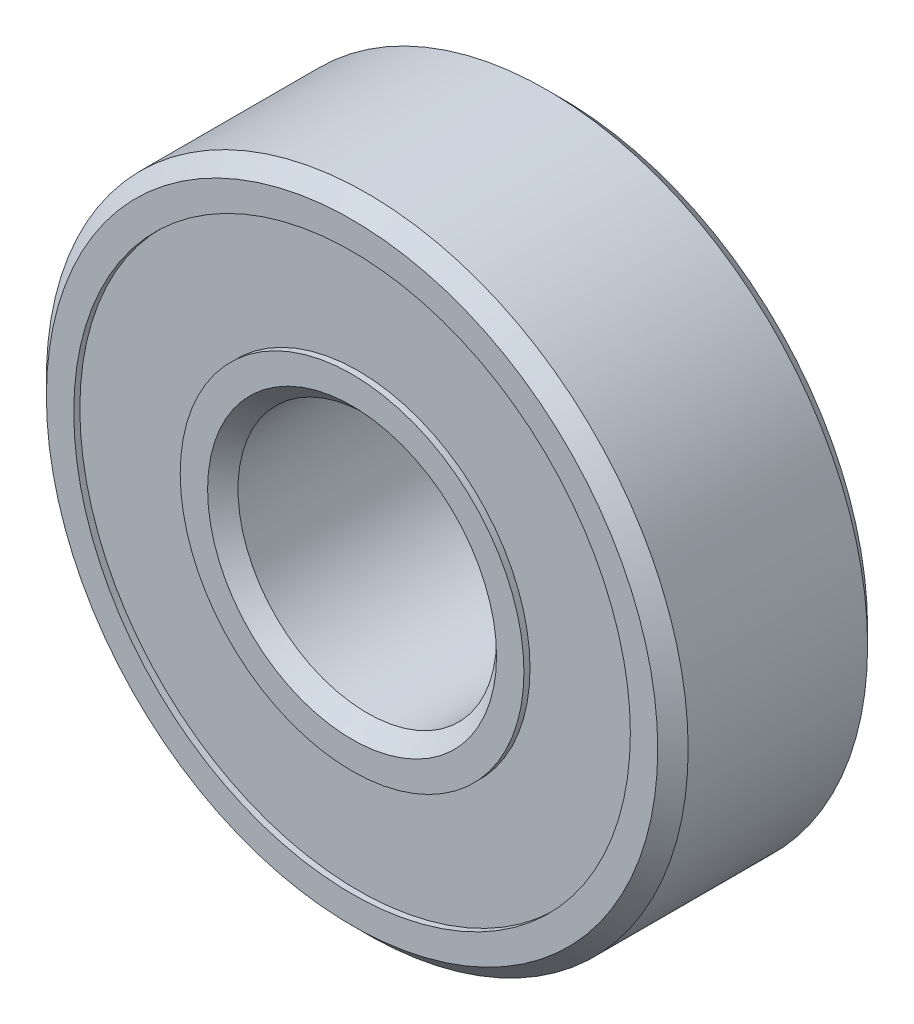
ISO-10303-21;
HEADER;
FILE_DESCRIPTION(('STEP AP214'),'2;1');
FILE_NAME('part.step','',(''),(''),'','','');
FILE_SCHEMA(('AUTOMOTIVE_DESIGN { 1 0 10303 214 1 1 1 1 }'));
ENDSEC;
DATA;
#1=APPLICATION_CONTEXT('core data for automotive mechanical design processes');
#2=APPLICATION_PROTOCOL_DEFINITION('international standard','automotive_design',2000,#1);
#3=PRODUCT_CONTEXT('',#1,'mechanical');
#4=PRODUCT('Part','Part','',(#3));
#5=PRODUCT_RELATED_PRODUCT_CATEGORY('part','',(#4));
#6=PRODUCT_DEFINITION_FORMATION('','',#4);
#7=PRODUCT_DEFINITION_CONTEXT('part definition',#1,'design');
#8=PRODUCT_DEFINITION('design','',#6,#7);
#9=PRODUCT_DEFINITION_SHAPE('','',#8);
#10=(LENGTH_UNIT() NAMED_UNIT(*) SI_UNIT(.MILLI.,.METRE.));
#11=(NAMED_UNIT(*) PLANE_ANGLE_UNIT() SI_UNIT($,.RADIAN.));
#12=(NAMED_UNIT(*) SI_UNIT($,.STERADIAN.) SOLID_ANGLE_UNIT());
#13=UNCERTAINTY_MEASURE_WITH_UNIT(LENGTH_MEASURE(1.E-05),#10,'distance_accuracy_value','');
#14=(GEOMETRIC_REPRESENTATION_CONTEXT(3) GLOBAL_UNCERTAINTY_ASSIGNED_CONTEXT((#13)) GLOBAL_UNIT_ASSIGNED_CONTEXT((#10,
#11,#12)) REPRESENTATION_CONTEXT('',''));
#15=CARTESIAN_POINT('',(0.,0.,0.));
#16=DIRECTION('',(0.,0.,1.));
#17=DIRECTION('',(1.,0.,0.));
#18=AXIS2_PLACEMENT_3D('',#15,#16,#17);
#19=CARTESIAN_POINT('',(0.,0.,3.45));
#20=DIRECTION('',(0.,0.,-1.));
#21=DIRECTION('',(-1.,0.,0.));
#22=AXIS2_PLACEMENT_3D('',#19,#20,#21);
#23=CYLINDRICAL_SURFACE('',#22,9.15);
#24=CARTESIAN_POINT('',(0.,0.,-3.45));
#25=DIRECTION('',(0.,0.,1.));
#26=DIRECTION('',(1.,0.,0.));
#27=AXIS2_PLACEMENT_3D('',#24,#25,#26);
#28=CIRCLE('',#27,9.15);
#29=CARTESIAN_POINT('',(9.15,0.,-3.45));
#30=VERTEX_POINT('',#29);
#31=EDGE_CURVE('E91',#30,#30,#28,.T.);
#32=ORIENTED_EDGE('',*,*,#31,.F.);
#33=EDGE_LOOP('',(#32));
#34=FACE_BOUND('',#33,.T.);
#35=CARTESIAN_POINT('',(0.,0.,-3.25));
#36=DIRECTION('',(0.,0.,1.));
#37=DIRECTION('',(1.,0.,0.));
#38=AXIS2_PLACEMENT_3D('',#35,#36,#37);
#39=CIRCLE('',#38,9.15);
#40=CARTESIAN_POINT('',(9.15,0.,-3.25));
#41=VERTEX_POINT('',#40);
#42=EDGE_CURVE('E94',#41,#41,#39,.T.);
#43=ORIENTED_EDGE('',*,*,#42,.T.);
#44=EDGE_LOOP('',(#43));
#45=FACE_BOUND('',#44,.T.);
#46=ADVANCED_FACE('F54',(#34,#45),#23,.F.);
#47=CARTESIAN_POINT('',(0.,0.,3.45));
#48=DIRECTION('',(0.,0.,1.));
#49=DIRECTION('',(1.,0.,0.));
#50=AXIS2_PLACEMENT_3D('',#47,#48,#49);
#51=PLANE('',#50);
#52=CARTESIAN_POINT('',(0.,0.,3.45));
#53=DIRECTION('',(0.,0.,1.));
#54=DIRECTION('',(1.,0.,0.));
#55=AXIS2_PLACEMENT_3D('',#52,#53,#54);
#56=CIRCLE('',#55,10.05);
#57=CARTESIAN_POINT('',(10.05,0.,3.45));
#58=VERTEX_POINT('',#57);
#59=EDGE_CURVE('E62',#58,#58,#56,.T.);
#60=ORIENTED_EDGE('',*,*,#59,.T.);
#61=EDGE_LOOP('',(#60));
#62=FACE_BOUND('',#61,.T.);
#63=CARTESIAN_POINT('',(0.,0.,3.45));
#64=DIRECTION('',(0.,0.,1.));
#65=DIRECTION('',(1.,0.,0.));
#66=AXIS2_PLACEMENT_3D('',#63,#64,#65);
#67=CIRCLE('',#66,9.15);
#68=CARTESIAN_POINT('',(9.15,0.,3.45));
#69=VERTEX_POINT('',#68);
#70=EDGE_CURVE('E90',#69,#69,#67,.T.);
#71=ORIENTED_EDGE('',*,*,#70,.F.);
#72=EDGE_LOOP('',(#71));
#73=FACE_BOUND('',#72,.T.);
#74=ADVANCED_FACE('F135',(#62,#73),#51,.T.);
#75=CARTESIAN_POINT('',(0.,0.,-3.45));
#76=DIRECTION('',(0.,0.,1.));
#77=DIRECTION('',(1.,0.,0.));
#78=AXIS2_PLACEMENT_3D('',#75,#76,#77);
#79=PLANE('',#78);
#80=CARTESIAN_POINT('',(0.,0.,-3.45));
#81=DIRECTION('',(0.,0.,1.));
#82=DIRECTION('',(1.,0.,0.));
#83=AXIS2_PLACEMENT_3D('',#80,#81,#82);
#84=CIRCLE('',#83,10.05);
#85=CARTESIAN_POINT('',(10.05,0.,-3.45));
#86=VERTEX_POINT('',#85);
#87=EDGE_CURVE('E66',#86,#86,#84,.F.);
#88=ORIENTED_EDGE('',*,*,#87,.T.);
#89=EDGE_LOOP('',(#88));
#90=FACE_BOUND('',#89,.T.);
#91=ORIENTED_EDGE('',*,*,#31,.T.);
#92=EDGE_LOOP('',(#91));
#93=FACE_BOUND('',#92,.T.);
#94=ADVANCED_FACE('F142',(#90,#93),#79,.F.);
#95=CARTESIAN_POINT('',(0.,0.,3.45));
#96=DIRECTION('',(0.,0.,-1.));
#97=DIRECTION('',(-1.,0.,0.));
#98=AXIS2_PLACEMENT_3D('',#95,#96,#97);
#99=CYLINDRICAL_SURFACE('',#98,10.55);
#100=CARTESIAN_POINT('',(0.,0.,-2.94999999999998));
#101=DIRECTION('',(0.,0.,1.));
#102=DIRECTION('',(1.,0.,0.));
#103=AXIS2_PLACEMENT_3D('',#100,#101,#102);
#104=CIRCLE('',#103,10.55);
#105=CARTESIAN_POINT('',(10.55,0.,-2.94999999999998));
#106=VERTEX_POINT('',#105);
#107=EDGE_CURVE('E70',#106,#106,#104,.T.);
#108=ORIENTED_EDGE('',*,*,#107,.T.);
#109=EDGE_LOOP('',(#108));
#110=FACE_BOUND('',#109,.T.);
#111=CARTESIAN_POINT('',(0.,0.,2.95000000000001));
#112=DIRECTION('',(0.,0.,1.));
#113=DIRECTION('',(1.,0.,0.));
#114=AXIS2_PLACEMENT_3D('',#111,#112,#113);
#115=CIRCLE('',#114,10.55);
#116=CARTESIAN_POINT('',(10.55,0.,2.95000000000001));
#117=VERTEX_POINT('',#116);
#118=EDGE_CURVE('E75',#117,#117,#115,.F.);
#119=ORIENTED_EDGE('',*,*,#118,.T.);
#120=EDGE_LOOP('',(#119));
#121=FACE_BOUND('',#120,.T.);
#122=ADVANCED_FACE('F149',(#110,#121),#99,.T.);
#123=CARTESIAN_POINT('',(0.,0.,3.25));
#124=DIRECTION('',(0.,0.,1.));
#125=DIRECTION('',(1.,0.,0.));
#126=AXIS2_PLACEMENT_3D('',#123,#124,#125);
#127=CIRCLE('',#126,9.15);
#128=CARTESIAN_POINT('',(9.15,0.,3.25));
#129=VERTEX_POINT('',#128);
#130=EDGE_CURVE('E87',#129,#129,#127,.T.);
#131=ORIENTED_EDGE('',*,*,#130,.F.);
#132=EDGE_LOOP('',(#131));
#133=FACE_BOUND('',#132,.T.);
#134=ORIENTED_EDGE('',*,*,#70,.T.);
#135=EDGE_LOOP('',(#134));
#136=FACE_BOUND('',#135,.T.);
#137=ADVANCED_FACE('F138',(#133,#136),#23,.F.);
#138=CARTESIAN_POINT('',(0.,0.,3.25));
#139=DIRECTION('',(0.,0.,1.));
#140=DIRECTION('',(1.,0.,0.));
#141=AXIS2_PLACEMENT_3D('',#138,#139,#140);
#142=PLANE('',#141);
#143=ORIENTED_EDGE('',*,*,#130,.T.);
#144=EDGE_LOOP('',(#143));
#145=FACE_BOUND('',#144,.T.);
#146=CARTESIAN_POINT('',(0.,0.,3.25));
#147=DIRECTION('',(0.,0.,1.));
#148=DIRECTION('',(1.,0.,0.));
#149=AXIS2_PLACEMENT_3D('',#146,#147,#148);
#150=CIRCLE('',#149,5.65);
#151=CARTESIAN_POINT('',(5.65,0.,3.25));
#152=VERTEX_POINT('',#151);
#153=EDGE_CURVE('E99',#152,#152,#150,.T.);
#154=ORIENTED_EDGE('',*,*,#153,.F.);
#155=EDGE_LOOP('',(#154));
#156=FACE_BOUND('',#155,.T.);
#157=ADVANCED_FACE('F148',(#145,#156),#142,.T.);
#158=CARTESIAN_POINT('',(0.,0.,-3.25));
#159=DIRECTION('',(0.,0.,1.));
#160=DIRECTION('',(1.,0.,0.));
#161=AXIS2_PLACEMENT_3D('',#158,#159,#160);
#162=PLANE('',#161);
#163=ORIENTED_EDGE('',*,*,#42,.F.);
#164=EDGE_LOOP('',(#163));
#165=FACE_BOUND('',#164,.T.);
#166=CARTESIAN_POINT('',(0.,0.,-3.25));
#167=DIRECTION('',(0.,0.,1.));
#168=DIRECTION('',(1.,0.,0.));
#169=AXIS2_PLACEMENT_3D('',#166,#167,#168);
#170=CIRCLE('',#169,5.65);
#171=CARTESIAN_POINT('',(5.65,0.,-3.25));
#172=VERTEX_POINT('',#171);
#173=EDGE_CURVE('E102',#172,#172,#170,.F.);
#174=ORIENTED_EDGE('',*,*,#173,.F.);
#175=EDGE_LOOP('',(#174));
#176=FACE_BOUND('',#175,.T.);
#177=ADVANCED_FACE('F132',(#165,#176),#162,.F.);
#178=CARTESIAN_POINT('',(0.,0.,3.45));
#179=DIRECTION('',(0.,0.,-1.));
#180=DIRECTION('',(-1.,0.,0.));
#181=AXIS2_PLACEMENT_3D('',#178,#179,#180);
#182=CYLINDRICAL_SURFACE('',#181,5.65);
#183=CARTESIAN_POINT('',(0.,0.,-3.45));
#184=DIRECTION('',(0.,0.,1.));
#185=DIRECTION('',(1.,0.,0.));
#186=AXIS2_PLACEMENT_3D('',#183,#184,#185);
#187=CIRCLE('',#186,5.65);
#188=CARTESIAN_POINT('',(5.65,0.,-3.45));
#189=VERTEX_POINT('',#188);
#190=EDGE_CURVE('E106',#189,#189,#187,.T.);
#191=ORIENTED_EDGE('',*,*,#190,.T.);
#192=EDGE_LOOP('',(#191));
#193=FACE_BOUND('',#192,.T.);
#194=ORIENTED_EDGE('',*,*,#173,.T.);
#195=EDGE_LOOP('',(#194));
#196=FACE_BOUND('',#195,.T.);
#197=ADVANCED_FACE('F120',(#193,#196),#182,.T.);
#198=CARTESIAN_POINT('',(0.,0.,3.45));
#199=DIRECTION('',(0.,0.,1.));
#200=DIRECTION('',(1.,0.,0.));
#201=AXIS2_PLACEMENT_3D('',#198,#199,#200);
#202=PLANE('',#201);
#203=CARTESIAN_POINT('',(0.,0.,3.45));
#204=DIRECTION('',(0.,0.,1.));
#205=DIRECTION('',(1.,0.,0.));
#206=AXIS2_PLACEMENT_3D('',#203,#204,#205);
#207=CIRCLE('',#206,4.75000000000002);
#208=CARTESIAN_POINT('',(4.75000000000002,0.,3.45));
#209=VERTEX_POINT('',#208);
#210=EDGE_CURVE('E11',#209,#209,#207,.F.);
#211=ORIENTED_EDGE('',*,*,#210,.T.);
#212=EDGE_LOOP('',(#211));
#213=FACE_BOUND('',#212,.T.);
#214=CARTESIAN_POINT('',(0.,0.,3.45));
#215=DIRECTION('',(0.,0.,1.));
#216=DIRECTION('',(1.,0.,0.));
#217=AXIS2_PLACEMENT_3D('',#214,#215,#216);
#218=CIRCLE('',#217,5.65);
#219=CARTESIAN_POINT('',(5.65,0.,3.45));
#220=VERTEX_POINT('',#219);
#221=EDGE_CURVE('E105',#220,#220,#218,.T.);
#222=ORIENTED_EDGE('',*,*,#221,.T.);
#223=EDGE_LOOP('',(#222));
#224=FACE_BOUND('',#223,.T.);
#225=ADVANCED_FACE('F112',(#213,#224),#202,.T.);
#226=CARTESIAN_POINT('',(0.,0.,-3.45));
#227=DIRECTION('',(0.,0.,1.));
#228=DIRECTION('',(1.,0.,0.));
#229=AXIS2_PLACEMENT_3D('',#226,#227,#228);
#230=PLANE('',#229);
#231=CARTESIAN_POINT('',(0.,0.,-3.45));
#232=DIRECTION('',(0.,0.,1.));
#233=DIRECTION('',(1.,0.,0.));
#234=AXIS2_PLACEMENT_3D('',#231,#232,#233);
#235=CIRCLE('',#234,4.74999999999999);
#236=CARTESIAN_POINT('',(4.74999999999999,0.,-3.45));
#237=VERTEX_POINT('',#236);
#238=EDGE_CURVE('E84',#237,#237,#235,.T.);
#239=ORIENTED_EDGE('',*,*,#238,.T.);
#240=EDGE_LOOP('',(#239));
#241=FACE_BOUND('',#240,.T.);
#242=ORIENTED_EDGE('',*,*,#190,.F.);
#243=EDGE_LOOP('',(#242));
#244=FACE_BOUND('',#243,.T.);
#245=ADVANCED_FACE('F117',(#241,#244),#230,.F.);
#246=ORIENTED_EDGE('',*,*,#153,.T.);
#247=EDGE_LOOP('',(#246));
#248=FACE_BOUND('',#247,.T.);
#249=ORIENTED_EDGE('',*,*,#221,.F.);
#250=EDGE_LOOP('',(#249));
#251=FACE_BOUND('',#250,.T.);
#252=ADVANCED_FACE('F114',(#248,#251),#182,.T.);
#253=CARTESIAN_POINT('',(0.,0.,3.45));
#254=DIRECTION('',(0.,0.,-1.));
#255=DIRECTION('',(-1.,0.,0.));
#256=AXIS2_PLACEMENT_3D('',#253,#254,#255);
#257=CYLINDRICAL_SURFACE('',#256,4.25);
#258=CARTESIAN_POINT('',(0.,0.,-2.95000000000002));
#259=DIRECTION('',(0.,0.,1.));
#260=DIRECTION('',(1.,0.,0.));
#261=AXIS2_PLACEMENT_3D('',#258,#259,#260);
#262=CIRCLE('',#261,4.25);
#263=CARTESIAN_POINT('',(4.25,0.,-2.95000000000002));
#264=VERTEX_POINT('',#263);
#265=EDGE_CURVE('E78',#264,#264,#262,.F.);
#266=ORIENTED_EDGE('',*,*,#265,.T.);
#267=EDGE_LOOP('',(#266));
#268=FACE_BOUND('',#267,.T.);
#269=CARTESIAN_POINT('',(0.,0.,2.94999999999998));
#270=DIRECTION('',(0.,0.,1.));
#271=DIRECTION('',(1.,0.,0.));
#272=AXIS2_PLACEMENT_3D('',#269,#270,#271);
#273=CIRCLE('',#272,4.25);
#274=CARTESIAN_POINT('',(4.25,0.,2.94999999999998));
#275=VERTEX_POINT('',#274);
#276=EDGE_CURVE('E81',#275,#275,#273,.T.);
#277=ORIENTED_EDGE('',*,*,#276,.T.);
#278=EDGE_LOOP('',(#277));
#279=FACE_BOUND('',#278,.T.);
#280=ADVANCED_FACE('F116',(#268,#279),#257,.F.);
#281=CARTESIAN_POINT('',(0.,0.,-3.45));
#282=DIRECTION('',(0.,0.,-1.));
#283=DIRECTION('',(-1.,0.,0.));
#284=AXIS2_PLACEMENT_3D('',#281,#282,#283);
#285=CONICAL_SURFACE('',#284,4.74999999999999,0.785398163397449);
#286=ORIENTED_EDGE('',*,*,#265,.F.);
#287=EDGE_LOOP('',(#286));
#288=FACE_BOUND('',#287,.T.);
#289=ORIENTED_EDGE('',*,*,#238,.F.);
#290=EDGE_LOOP('',(#289));
#291=FACE_BOUND('',#290,.T.);
#292=ADVANCED_FACE('F125',(#288,#291),#285,.F.);
#293=CARTESIAN_POINT('',(0.,0.,-2.94999999999998));
#294=DIRECTION('',(0.,0.,1.));
#295=DIRECTION('',(1.,0.,0.));
#296=AXIS2_PLACEMENT_3D('',#293,#294,#295);
#297=CONICAL_SURFACE('',#296,10.55,0.78539816339745);
#298=ORIENTED_EDGE('',*,*,#87,.F.);
#299=EDGE_LOOP('',(#298));
#300=FACE_BOUND('',#299,.T.);
#301=ORIENTED_EDGE('',*,*,#107,.F.);
#302=EDGE_LOOP('',(#301));
#303=FACE_BOUND('',#302,.T.);
#304=ADVANCED_FACE('F177',(#300,#303),#297,.T.);
#305=CARTESIAN_POINT('',(0.,0.,3.45));
#306=DIRECTION('',(0.,0.,-1.));
#307=DIRECTION('',(-1.,0.,0.));
#308=AXIS2_PLACEMENT_3D('',#305,#306,#307);
#309=CONICAL_SURFACE('',#308,10.05,0.785398163397447);
#310=ORIENTED_EDGE('',*,*,#118,.F.);
#311=EDGE_LOOP('',(#310));
#312=FACE_BOUND('',#311,.T.);
#313=ORIENTED_EDGE('',*,*,#59,.F.);
#314=EDGE_LOOP('',(#313));
#315=FACE_BOUND('',#314,.T.);
#316=ADVANCED_FACE('F183',(#312,#315),#309,.T.);
#317=CARTESIAN_POINT('',(0.,0.,2.94999999999998));
#318=DIRECTION('',(0.,0.,1.));
#319=DIRECTION('',(1.,0.,0.));
#320=AXIS2_PLACEMENT_3D('',#317,#318,#319);
#321=CONICAL_SURFACE('',#320,4.25,0.785398163397447);
#322=ORIENTED_EDGE('',*,*,#210,.F.);
#323=EDGE_LOOP('',(#322));
#324=FACE_BOUND('',#323,.T.);
#325=ORIENTED_EDGE('',*,*,#276,.F.);
#326=EDGE_LOOP('',(#325));
#327=FACE_BOUND('',#326,.T.);
#328=ADVANCED_FACE('F57',(#324,#327),#321,.F.);
#329=CLOSED_SHELL('',(#46,#74,#94,#122,#137,#157,#177,#197,#225,#245,#252,#280,#292,#304,#316,#328));
#330=MANIFOLD_SOLID_BREP('B2',#329);
#331=ADVANCED_BREP_SHAPE_REPRESENTATION('',(#18,#330),#14);
#332=SHAPE_DEFINITION_REPRESENTATION(#9,#331);
ENDSEC;
END-ISO-10303-21;
